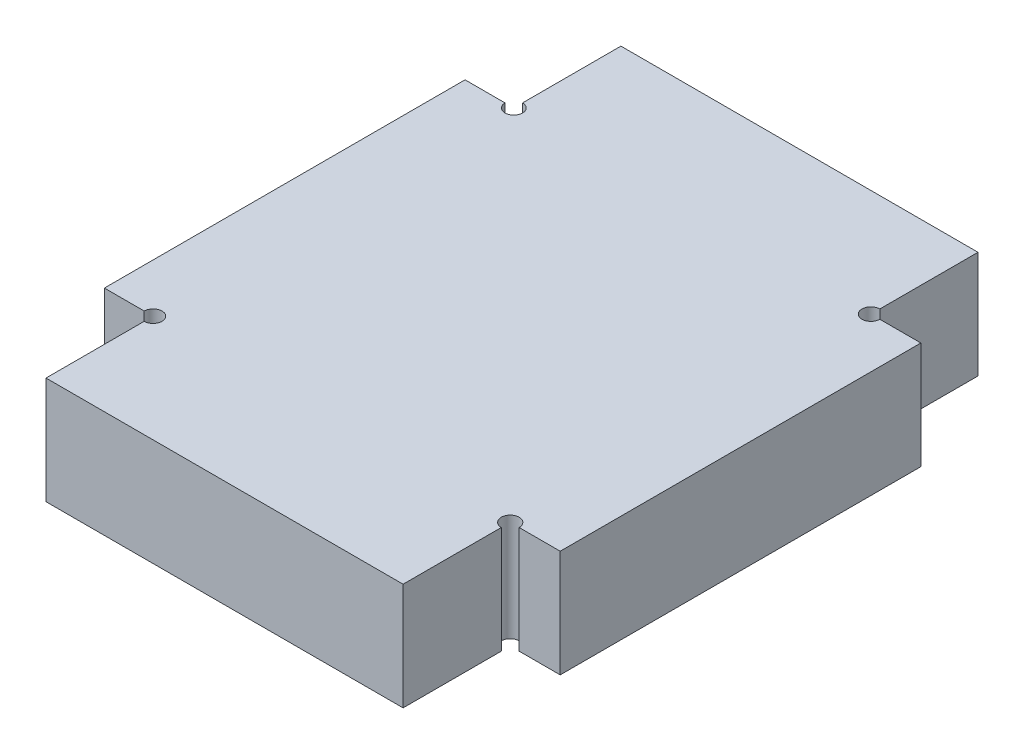
ISO-10303-21;
HEADER;
FILE_DESCRIPTION(('STEP AP214'),'2;1');
FILE_NAME('part.step','',(''),(''),'','','');
FILE_SCHEMA(('AUTOMOTIVE_DESIGN { 1 0 10303 214 1 1 1 1 }'));
ENDSEC;
DATA;
#1=APPLICATION_CONTEXT('core data for automotive mechanical design processes');
#2=APPLICATION_PROTOCOL_DEFINITION('international standard','automotive_design',2000,#1);
#3=PRODUCT_CONTEXT('',#1,'mechanical');
#4=PRODUCT('Part','Part','',(#3));
#5=PRODUCT_RELATED_PRODUCT_CATEGORY('part','',(#4));
#6=PRODUCT_DEFINITION_FORMATION('','',#4);
#7=PRODUCT_DEFINITION_CONTEXT('part definition',#1,'design');
#8=PRODUCT_DEFINITION('design','',#6,#7);
#9=PRODUCT_DEFINITION_SHAPE('','',#8);
#10=(LENGTH_UNIT() NAMED_UNIT(*) SI_UNIT(.MILLI.,.METRE.));
#11=(NAMED_UNIT(*) PLANE_ANGLE_UNIT() SI_UNIT($,.RADIAN.));
#12=(NAMED_UNIT(*) SI_UNIT($,.STERADIAN.) SOLID_ANGLE_UNIT());
#13=UNCERTAINTY_MEASURE_WITH_UNIT(LENGTH_MEASURE(1.E-05),#10,'distance_accuracy_value','');
#14=(GEOMETRIC_REPRESENTATION_CONTEXT(3) GLOBAL_UNCERTAINTY_ASSIGNED_CONTEXT((#13)) GLOBAL_UNIT_ASSIGNED_CONTEXT((#10,
#11,#12)) REPRESENTATION_CONTEXT('',''));
#15=CARTESIAN_POINT('',(0.,0.,0.));
#16=DIRECTION('',(0.,0.,1.));
#17=DIRECTION('',(1.,0.,0.));
#18=AXIS2_PLACEMENT_3D('',#15,#16,#17);
#19=CARTESIAN_POINT('',(1.4,3.,-5.33212290502793));
#20=DIRECTION('',(-1.,0.,0.));
#21=DIRECTION('',(0.,0.,1.));
#22=AXIS2_PLACEMENT_3D('',#19,#20,#21);
#23=PLANE('',#22);
#24=DIRECTION('',(0.,0.,-1.));
#25=VECTOR('',#24,1.);
#26=CARTESIAN_POINT('',(1.4,0.,-5.33212290502793));
#27=LINE('',#26,#25);
#28=CARTESIAN_POINT('',(1.4,0.,4.76787709497207));
#29=VERTEX_POINT('',#28);
#30=CARTESIAN_POINT('',(1.4,0.,-5.33212290502793));
#31=VERTEX_POINT('',#30);
#32=EDGE_CURVE('E177',#29,#31,#27,.T.);
#33=ORIENTED_EDGE('',*,*,#32,.T.);
#34=DIRECTION('',(0.,-1.,0.));
#35=VECTOR('',#34,1.);
#36=CARTESIAN_POINT('',(1.4,3.,-5.33212290502793));
#37=LINE('',#36,#35);
#38=CARTESIAN_POINT('',(1.4,3.,-5.33212290502793));
#39=VERTEX_POINT('',#38);
#40=EDGE_CURVE('E11',#39,#31,#37,.T.);
#41=ORIENTED_EDGE('',*,*,#40,.F.);
#42=DIRECTION('',(0.,0.,-1.));
#43=VECTOR('',#42,1.);
#44=CARTESIAN_POINT('',(1.4,3.,-5.33212290502793));
#45=LINE('',#44,#43);
#46=CARTESIAN_POINT('',(1.4,3.,4.76787709497207));
#47=VERTEX_POINT('',#46);
#48=EDGE_CURVE('E207',#47,#39,#45,.T.);
#49=ORIENTED_EDGE('',*,*,#48,.F.);
#50=DIRECTION('',(0.,-1.,0.));
#51=VECTOR('',#50,1.);
#52=CARTESIAN_POINT('',(1.4,3.,4.76787709497207));
#53=LINE('',#52,#51);
#54=EDGE_CURVE('E173',#47,#29,#53,.T.);
#55=ORIENTED_EDGE('',*,*,#54,.T.);
#56=EDGE_LOOP('',(#33,#41,#49,#55));
#57=FACE_BOUND('',#56,.T.);
#58=ADVANCED_FACE('F33',(#57),#23,.F.);
#59=CARTESIAN_POINT('',(0.25,3.,-5.33212290502793));
#60=DIRECTION('',(0.,0.,1.));
#61=DIRECTION('',(1.,0.,0.));
#62=AXIS2_PLACEMENT_3D('',#59,#60,#61);
#63=PLANE('',#62);
#64=DIRECTION('',(-1.,0.,0.));
#65=VECTOR('',#64,1.);
#66=CARTESIAN_POINT('',(0.25,0.,-5.33212290502793));
#67=LINE('',#66,#65);
#68=CARTESIAN_POINT('',(0.25,0.,-5.33212290502793));
#69=VERTEX_POINT('',#68);
#70=EDGE_CURVE('E180',#31,#69,#67,.T.);
#71=ORIENTED_EDGE('',*,*,#70,.T.);
#72=DIRECTION('',(0.,-1.,0.));
#73=VECTOR('',#72,1.);
#74=CARTESIAN_POINT('',(0.25,3.,-5.33212290502793));
#75=LINE('',#74,#73);
#76=CARTESIAN_POINT('',(0.25,3.,-5.33212290502793));
#77=VERTEX_POINT('',#76);
#78=EDGE_CURVE('E41',#77,#69,#75,.T.);
#79=ORIENTED_EDGE('',*,*,#78,.F.);
#80=DIRECTION('',(-1.,0.,0.));
#81=VECTOR('',#80,1.);
#82=CARTESIAN_POINT('',(0.25,3.,-5.33212290502793));
#83=LINE('',#82,#81);
#84=EDGE_CURVE('E116',#39,#77,#83,.T.);
#85=ORIENTED_EDGE('',*,*,#84,.F.);
#86=ORIENTED_EDGE('',*,*,#40,.T.);
#87=EDGE_LOOP('',(#71,#79,#85,#86));
#88=FACE_BOUND('',#87,.T.);
#89=ADVANCED_FACE('F305',(#88),#63,.F.);
#90=CARTESIAN_POINT('',(0.,3.,-5.33212290502793));
#91=DIRECTION('',(0.,-1.,0.));
#92=DIRECTION('',(0.,0.,-1.));
#93=AXIS2_PLACEMENT_3D('',#90,#91,#92);
#94=CYLINDRICAL_SURFACE('',#93,0.25);
#95=CARTESIAN_POINT('',(0.,0.,-5.33212290502793));
#96=DIRECTION('',(0.,-1.,0.));
#97=DIRECTION('',(0.,0.,1.));
#98=AXIS2_PLACEMENT_3D('',#95,#96,#97);
#99=CIRCLE('',#98,0.25);
#100=CARTESIAN_POINT('',(0.,0.,-5.58212290502793));
#101=VERTEX_POINT('',#100);
#102=EDGE_CURVE('E182',#69,#101,#99,.T.);
#103=ORIENTED_EDGE('',*,*,#102,.T.);
#104=DIRECTION('',(0.,-1.,0.));
#105=VECTOR('',#104,1.);
#106=CARTESIAN_POINT('',(0.,3.,-5.58212290502793));
#107=LINE('',#106,#105);
#108=CARTESIAN_POINT('',(0.,3.,-5.58212290502793));
#109=VERTEX_POINT('',#108);
#110=EDGE_CURVE('E238',#109,#101,#107,.T.);
#111=ORIENTED_EDGE('',*,*,#110,.F.);
#112=CARTESIAN_POINT('',(0.,3.,-5.33212290502793));
#113=DIRECTION('',(0.,-1.,0.));
#114=DIRECTION('',(0.,0.,1.));
#115=AXIS2_PLACEMENT_3D('',#112,#113,#114);
#116=CIRCLE('',#115,0.25);
#117=EDGE_CURVE('E246',#77,#109,#116,.T.);
#118=ORIENTED_EDGE('',*,*,#117,.F.);
#119=ORIENTED_EDGE('',*,*,#78,.T.);
#120=EDGE_LOOP('',(#103,#111,#118,#119));
#121=FACE_BOUND('',#120,.T.);
#122=ADVANCED_FACE('F244',(#121),#94,.F.);
#123=CARTESIAN_POINT('',(0.,3.,-5.58212290502793));
#124=DIRECTION('',(-1.,0.,0.));
#125=DIRECTION('',(0.,0.,1.));
#126=AXIS2_PLACEMENT_3D('',#123,#124,#125);
#127=PLANE('',#126);
#128=DIRECTION('',(0.,0.,-1.));
#129=VECTOR('',#128,1.);
#130=CARTESIAN_POINT('',(0.,0.,-5.58212290502793));
#131=LINE('',#130,#129);
#132=CARTESIAN_POINT('',(0.,0.,-8.33212290502794));
#133=VERTEX_POINT('',#132);
#134=EDGE_CURVE('E184',#101,#133,#131,.T.);
#135=ORIENTED_EDGE('',*,*,#134,.T.);
#136=DIRECTION('',(0.,-1.,0.));
#137=VECTOR('',#136,1.);
#138=CARTESIAN_POINT('',(0.,3.,-8.33212290502794));
#139=LINE('',#138,#137);
#140=CARTESIAN_POINT('',(0.,3.,-8.33212290502794));
#141=VERTEX_POINT('',#140);
#142=EDGE_CURVE('E235',#141,#133,#139,.T.);
#143=ORIENTED_EDGE('',*,*,#142,.F.);
#144=DIRECTION('',(0.,0.,-1.));
#145=VECTOR('',#144,1.);
#146=CARTESIAN_POINT('',(0.,3.,-5.58212290502793));
#147=LINE('',#146,#145);
#148=EDGE_CURVE('E264',#109,#141,#147,.T.);
#149=ORIENTED_EDGE('',*,*,#148,.F.);
#150=ORIENTED_EDGE('',*,*,#110,.T.);
#151=EDGE_LOOP('',(#135,#143,#149,#150));
#152=FACE_BOUND('',#151,.T.);
#153=ADVANCED_FACE('F255',(#152),#127,.F.);
#154=CARTESIAN_POINT('',(0.,3.,-8.33212290502794));
#155=DIRECTION('',(0.,0.,1.));
#156=DIRECTION('',(1.,0.,0.));
#157=AXIS2_PLACEMENT_3D('',#154,#155,#156);
#158=PLANE('',#157);
#159=DIRECTION('',(-1.,0.,0.));
#160=VECTOR('',#159,1.);
#161=CARTESIAN_POINT('',(0.,0.,-8.33212290502794));
#162=LINE('',#161,#160);
#163=CARTESIAN_POINT('',(-10.,0.,-8.33212290502793));
#164=VERTEX_POINT('',#163);
#165=EDGE_CURVE('E186',#133,#164,#162,.T.);
#166=ORIENTED_EDGE('',*,*,#165,.T.);
#167=DIRECTION('',(0.,-1.,0.));
#168=VECTOR('',#167,1.);
#169=CARTESIAN_POINT('',(-10.,3.,-8.33212290502793));
#170=LINE('',#169,#168);
#171=CARTESIAN_POINT('',(-10.,3.,-8.33212290502793));
#172=VERTEX_POINT('',#171);
#173=EDGE_CURVE('E232',#172,#164,#170,.T.);
#174=ORIENTED_EDGE('',*,*,#173,.F.);
#175=DIRECTION('',(-1.,0.,0.));
#176=VECTOR('',#175,1.);
#177=CARTESIAN_POINT('',(0.,3.,-8.33212290502794));
#178=LINE('',#177,#176);
#179=EDGE_CURVE('E261',#141,#172,#178,.T.);
#180=ORIENTED_EDGE('',*,*,#179,.F.);
#181=ORIENTED_EDGE('',*,*,#142,.T.);
#182=EDGE_LOOP('',(#166,#174,#180,#181));
#183=FACE_BOUND('',#182,.T.);
#184=ADVANCED_FACE('F259',(#183),#158,.F.);
#185=CARTESIAN_POINT('',(-10.,3.,-8.33212290502793));
#186=DIRECTION('',(1.,0.,0.));
#187=DIRECTION('',(0.,0.,-1.));
#188=AXIS2_PLACEMENT_3D('',#185,#186,#187);
#189=PLANE('',#188);
#190=DIRECTION('',(0.,0.,1.));
#191=VECTOR('',#190,1.);
#192=CARTESIAN_POINT('',(-10.,0.,-8.33212290502793));
#193=LINE('',#192,#191);
#194=CARTESIAN_POINT('',(-10.,0.,-5.57738217807717));
#195=VERTEX_POINT('',#194);
#196=EDGE_CURVE('E188',#164,#195,#193,.T.);
#197=ORIENTED_EDGE('',*,*,#196,.T.);
#198=DIRECTION('',(0.,-1.,0.));
#199=VECTOR('',#198,1.);
#200=CARTESIAN_POINT('',(-10.,3.,-5.57738217807717));
#201=LINE('',#200,#199);
#202=CARTESIAN_POINT('',(-10.,3.,-5.57738217807717));
#203=VERTEX_POINT('',#202);
#204=EDGE_CURVE('E229',#203,#195,#201,.T.);
#205=ORIENTED_EDGE('',*,*,#204,.F.);
#206=DIRECTION('',(0.,0.,1.));
#207=VECTOR('',#206,1.);
#208=CARTESIAN_POINT('',(-10.,3.,-8.33212290502793));
#209=LINE('',#208,#207);
#210=EDGE_CURVE('E263',#172,#203,#209,.T.);
#211=ORIENTED_EDGE('',*,*,#210,.F.);
#212=ORIENTED_EDGE('',*,*,#173,.T.);
#213=EDGE_LOOP('',(#197,#205,#211,#212));
#214=FACE_BOUND('',#213,.T.);
#215=ADVANCED_FACE('F318',(#214),#189,.F.);
#216=CARTESIAN_POINT('',(-10.,3.,-5.33212290502793));
#217=DIRECTION('',(0.,-1.,0.));
#218=DIRECTION('',(0.,0.,-1.));
#219=AXIS2_PLACEMENT_3D('',#216,#217,#218);
#220=CYLINDRICAL_SURFACE('',#219,0.245259273049239);
#221=CARTESIAN_POINT('',(-10.,0.,-5.33212290502793));
#222=DIRECTION('',(0.,-1.,0.));
#223=DIRECTION('',(0.,0.,1.));
#224=AXIS2_PLACEMENT_3D('',#221,#222,#223);
#225=CIRCLE('',#224,0.245259273049239);
#226=CARTESIAN_POINT('',(-10.2452592730492,0.,-5.33212290502793));
#227=VERTEX_POINT('',#226);
#228=EDGE_CURVE('E190',#195,#227,#225,.T.);
#229=ORIENTED_EDGE('',*,*,#228,.T.);
#230=DIRECTION('',(0.,-1.,0.));
#231=VECTOR('',#230,1.);
#232=CARTESIAN_POINT('',(-10.2452592730492,3.,-5.33212290502793));
#233=LINE('',#232,#231);
#234=CARTESIAN_POINT('',(-10.2452592730492,3.,-5.33212290502793));
#235=VERTEX_POINT('',#234);
#236=EDGE_CURVE('E226',#235,#227,#233,.T.);
#237=ORIENTED_EDGE('',*,*,#236,.F.);
#238=CARTESIAN_POINT('',(-10.,3.,-5.33212290502793));
#239=DIRECTION('',(0.,-1.,0.));
#240=DIRECTION('',(0.,0.,1.));
#241=AXIS2_PLACEMENT_3D('',#238,#239,#240);
#242=CIRCLE('',#241,0.245259273049239);
#243=EDGE_CURVE('E266',#203,#235,#242,.T.);
#244=ORIENTED_EDGE('',*,*,#243,.F.);
#245=ORIENTED_EDGE('',*,*,#204,.T.);
#246=EDGE_LOOP('',(#229,#237,#244,#245));
#247=FACE_BOUND('',#246,.T.);
#248=ADVANCED_FACE('F321',(#247),#220,.F.);
#249=CARTESIAN_POINT('',(-10.2452592730492,3.,-5.33212290502793));
#250=DIRECTION('',(0.,0.,1.));
#251=DIRECTION('',(1.,0.,0.));
#252=AXIS2_PLACEMENT_3D('',#249,#250,#251);
#253=PLANE('',#252);
#254=DIRECTION('',(-1.,0.,0.));
#255=VECTOR('',#254,1.);
#256=CARTESIAN_POINT('',(-10.2452592730492,0.,-5.33212290502793));
#257=LINE('',#256,#255);
#258=CARTESIAN_POINT('',(-11.3646914249073,0.,-5.33212290502793));
#259=VERTEX_POINT('',#258);
#260=EDGE_CURVE('E192',#227,#259,#257,.T.);
#261=ORIENTED_EDGE('',*,*,#260,.T.);
#262=DIRECTION('',(0.,-1.,0.));
#263=VECTOR('',#262,1.);
#264=CARTESIAN_POINT('',(-11.3646914249073,3.,-5.33212290502793));
#265=LINE('',#264,#263);
#266=CARTESIAN_POINT('',(-11.3646914249073,3.,-5.33212290502793));
#267=VERTEX_POINT('',#266);
#268=EDGE_CURVE('E223',#267,#259,#265,.T.);
#269=ORIENTED_EDGE('',*,*,#268,.F.);
#270=DIRECTION('',(-1.,0.,0.));
#271=VECTOR('',#270,1.);
#272=CARTESIAN_POINT('',(-10.2452592730492,3.,-5.33212290502793));
#273=LINE('',#272,#271);
#274=EDGE_CURVE('E272',#235,#267,#273,.T.);
#275=ORIENTED_EDGE('',*,*,#274,.F.);
#276=ORIENTED_EDGE('',*,*,#236,.T.);
#277=EDGE_LOOP('',(#261,#269,#275,#276));
#278=FACE_BOUND('',#277,.T.);
#279=ADVANCED_FACE('F325',(#278),#253,.F.);
#280=CARTESIAN_POINT('',(-11.3646914249073,3.,4.76787709497207));
#281=DIRECTION('',(1.,0.,0.));
#282=DIRECTION('',(0.,0.,-1.));
#283=AXIS2_PLACEMENT_3D('',#280,#281,#282);
#284=PLANE('',#283);
#285=DIRECTION('',(0.,0.,1.));
#286=VECTOR('',#285,1.);
#287=CARTESIAN_POINT('',(-11.3646914249073,0.,4.76787709497207));
#288=LINE('',#287,#286);
#289=CARTESIAN_POINT('',(-11.3646914249073,0.,4.76787709497207));
#290=VERTEX_POINT('',#289);
#291=EDGE_CURVE('E194',#259,#290,#288,.T.);
#292=ORIENTED_EDGE('',*,*,#291,.T.);
#293=DIRECTION('',(0.,-1.,0.));
#294=VECTOR('',#293,1.);
#295=CARTESIAN_POINT('',(-11.3646914249073,3.,4.76787709497207));
#296=LINE('',#295,#294);
#297=CARTESIAN_POINT('',(-11.3646914249073,3.,4.76787709497207));
#298=VERTEX_POINT('',#297);
#299=EDGE_CURVE('E220',#298,#290,#296,.T.);
#300=ORIENTED_EDGE('',*,*,#299,.F.);
#301=DIRECTION('',(0.,0.,1.));
#302=VECTOR('',#301,1.);
#303=CARTESIAN_POINT('',(-11.3646914249073,3.,4.76787709497207));
#304=LINE('',#303,#302);
#305=EDGE_CURVE('E274',#267,#298,#304,.T.);
#306=ORIENTED_EDGE('',*,*,#305,.F.);
#307=ORIENTED_EDGE('',*,*,#268,.T.);
#308=EDGE_LOOP('',(#292,#300,#306,#307));
#309=FACE_BOUND('',#308,.T.);
#310=ADVANCED_FACE('F329',(#309),#284,.F.);
#311=CARTESIAN_POINT('',(-10.25,3.,4.76787709497207));
#312=DIRECTION('',(0.,0.,-1.));
#313=DIRECTION('',(-1.,0.,0.));
#314=AXIS2_PLACEMENT_3D('',#311,#312,#313);
#315=PLANE('',#314);
#316=DIRECTION('',(1.,0.,0.));
#317=VECTOR('',#316,1.);
#318=CARTESIAN_POINT('',(-10.25,0.,4.76787709497207));
#319=LINE('',#318,#317);
#320=CARTESIAN_POINT('',(-10.25,0.,4.76787709497207));
#321=VERTEX_POINT('',#320);
#322=EDGE_CURVE('E196',#290,#321,#319,.T.);
#323=ORIENTED_EDGE('',*,*,#322,.T.);
#324=DIRECTION('',(0.,-1.,0.));
#325=VECTOR('',#324,1.);
#326=CARTESIAN_POINT('',(-10.25,3.,4.76787709497207));
#327=LINE('',#326,#325);
#328=CARTESIAN_POINT('',(-10.25,3.,4.76787709497207));
#329=VERTEX_POINT('',#328);
#330=EDGE_CURVE('E217',#329,#321,#327,.T.);
#331=ORIENTED_EDGE('',*,*,#330,.F.);
#332=DIRECTION('',(1.,0.,0.));
#333=VECTOR('',#332,1.);
#334=CARTESIAN_POINT('',(-10.25,3.,4.76787709497207));
#335=LINE('',#334,#333);
#336=EDGE_CURVE('E276',#298,#329,#335,.T.);
#337=ORIENTED_EDGE('',*,*,#336,.F.);
#338=ORIENTED_EDGE('',*,*,#299,.T.);
#339=EDGE_LOOP('',(#323,#331,#337,#338));
#340=FACE_BOUND('',#339,.T.);
#341=ADVANCED_FACE('F333',(#340),#315,.F.);
#342=CARTESIAN_POINT('',(-10.,3.,4.76787709497207));
#343=DIRECTION('',(0.,-1.,0.));
#344=DIRECTION('',(0.,0.,-1.));
#345=AXIS2_PLACEMENT_3D('',#342,#343,#344);
#346=CYLINDRICAL_SURFACE('',#345,0.25);
#347=CARTESIAN_POINT('',(-10.,0.,4.76787709497207));
#348=DIRECTION('',(0.,-1.,0.));
#349=DIRECTION('',(0.,0.,1.));
#350=AXIS2_PLACEMENT_3D('',#347,#348,#349);
#351=CIRCLE('',#350,0.25);
#352=CARTESIAN_POINT('',(-10.,0.,5.01787709497207));
#353=VERTEX_POINT('',#352);
#354=EDGE_CURVE('E198',#321,#353,#351,.T.);
#355=ORIENTED_EDGE('',*,*,#354,.T.);
#356=DIRECTION('',(0.,-1.,0.));
#357=VECTOR('',#356,1.);
#358=CARTESIAN_POINT('',(-10.,3.,5.01787709497207));
#359=LINE('',#358,#357);
#360=CARTESIAN_POINT('',(-10.,3.,5.01787709497207));
#361=VERTEX_POINT('',#360);
#362=EDGE_CURVE('E214',#361,#353,#359,.T.);
#363=ORIENTED_EDGE('',*,*,#362,.F.);
#364=CARTESIAN_POINT('',(-10.,3.,4.76787709497207));
#365=DIRECTION('',(0.,-1.,0.));
#366=DIRECTION('',(0.,0.,1.));
#367=AXIS2_PLACEMENT_3D('',#364,#365,#366);
#368=CIRCLE('',#367,0.25);
#369=EDGE_CURVE('E278',#329,#361,#368,.T.);
#370=ORIENTED_EDGE('',*,*,#369,.F.);
#371=ORIENTED_EDGE('',*,*,#330,.T.);
#372=EDGE_LOOP('',(#355,#363,#370,#371));
#373=FACE_BOUND('',#372,.T.);
#374=ADVANCED_FACE('F337',(#373),#346,.F.);
#375=CARTESIAN_POINT('',(-10.,3.,7.76787709497207));
#376=DIRECTION('',(1.,0.,0.));
#377=DIRECTION('',(0.,0.,-1.));
#378=AXIS2_PLACEMENT_3D('',#375,#376,#377);
#379=PLANE('',#378);
#380=DIRECTION('',(0.,0.,1.));
#381=VECTOR('',#380,1.);
#382=CARTESIAN_POINT('',(-10.,0.,7.76787709497207));
#383=LINE('',#382,#381);
#384=CARTESIAN_POINT('',(-10.,0.,7.76787709497207));
#385=VERTEX_POINT('',#384);
#386=EDGE_CURVE('E200',#353,#385,#383,.T.);
#387=ORIENTED_EDGE('',*,*,#386,.T.);
#388=DIRECTION('',(0.,-1.,0.));
#389=VECTOR('',#388,1.);
#390=CARTESIAN_POINT('',(-10.,3.,7.76787709497207));
#391=LINE('',#390,#389);
#392=CARTESIAN_POINT('',(-10.,3.,7.76787709497207));
#393=VERTEX_POINT('',#392);
#394=EDGE_CURVE('E211',#393,#385,#391,.T.);
#395=ORIENTED_EDGE('',*,*,#394,.F.);
#396=DIRECTION('',(0.,0.,1.));
#397=VECTOR('',#396,1.);
#398=CARTESIAN_POINT('',(-10.,3.,7.76787709497207));
#399=LINE('',#398,#397);
#400=EDGE_CURVE('E280',#361,#393,#399,.T.);
#401=ORIENTED_EDGE('',*,*,#400,.F.);
#402=ORIENTED_EDGE('',*,*,#362,.T.);
#403=EDGE_LOOP('',(#387,#395,#401,#402));
#404=FACE_BOUND('',#403,.T.);
#405=ADVANCED_FACE('F286',(#404),#379,.F.);
#406=CARTESIAN_POINT('',(0.,3.,7.76787709497207));
#407=DIRECTION('',(0.,0.,-1.));
#408=DIRECTION('',(-1.,0.,0.));
#409=AXIS2_PLACEMENT_3D('',#406,#407,#408);
#410=PLANE('',#409);
#411=DIRECTION('',(1.,0.,0.));
#412=VECTOR('',#411,1.);
#413=CARTESIAN_POINT('',(0.,0.,7.76787709497207));
#414=LINE('',#413,#412);
#415=CARTESIAN_POINT('',(0.,0.,7.76787709497207));
#416=VERTEX_POINT('',#415);
#417=EDGE_CURVE('E202',#385,#416,#414,.T.);
#418=ORIENTED_EDGE('',*,*,#417,.T.);
#419=DIRECTION('',(0.,-1.,0.));
#420=VECTOR('',#419,1.);
#421=CARTESIAN_POINT('',(0.,3.,7.76787709497207));
#422=LINE('',#421,#420);
#423=CARTESIAN_POINT('',(0.,3.,7.76787709497207));
#424=VERTEX_POINT('',#423);
#425=EDGE_CURVE('E168',#424,#416,#422,.T.);
#426=ORIENTED_EDGE('',*,*,#425,.F.);
#427=DIRECTION('',(1.,0.,0.));
#428=VECTOR('',#427,1.);
#429=CARTESIAN_POINT('',(0.,3.,7.76787709497207));
#430=LINE('',#429,#428);
#431=EDGE_CURVE('E159',#393,#424,#430,.T.);
#432=ORIENTED_EDGE('',*,*,#431,.F.);
#433=ORIENTED_EDGE('',*,*,#394,.T.);
#434=EDGE_LOOP('',(#418,#426,#432,#433));
#435=FACE_BOUND('',#434,.T.);
#436=ADVANCED_FACE('F290',(#435),#410,.F.);
#437=CARTESIAN_POINT('',(0.,3.,5.01787709497207));
#438=DIRECTION('',(-1.,0.,0.));
#439=DIRECTION('',(0.,0.,1.));
#440=AXIS2_PLACEMENT_3D('',#437,#438,#439);
#441=PLANE('',#440);
#442=DIRECTION('',(0.,0.,-1.));
#443=VECTOR('',#442,1.);
#444=CARTESIAN_POINT('',(0.,0.,5.01787709497207));
#445=LINE('',#444,#443);
#446=CARTESIAN_POINT('',(0.,0.,5.01787709497207));
#447=VERTEX_POINT('',#446);
#448=EDGE_CURVE('E167',#416,#447,#445,.T.);
#449=ORIENTED_EDGE('',*,*,#448,.T.);
#450=DIRECTION('',(0.,-1.,0.));
#451=VECTOR('',#450,1.);
#452=CARTESIAN_POINT('',(0.,3.,5.01787709497207));
#453=LINE('',#452,#451);
#454=CARTESIAN_POINT('',(0.,3.,5.01787709497207));
#455=VERTEX_POINT('',#454);
#456=EDGE_CURVE('E164',#455,#447,#453,.T.);
#457=ORIENTED_EDGE('',*,*,#456,.F.);
#458=DIRECTION('',(0.,0.,-1.));
#459=VECTOR('',#458,1.);
#460=CARTESIAN_POINT('',(0.,3.,5.01787709497207));
#461=LINE('',#460,#459);
#462=EDGE_CURVE('E153',#424,#455,#461,.T.);
#463=ORIENTED_EDGE('',*,*,#462,.F.);
#464=ORIENTED_EDGE('',*,*,#425,.T.);
#465=EDGE_LOOP('',(#449,#457,#463,#464));
#466=FACE_BOUND('',#465,.T.);
#467=ADVANCED_FACE('F165',(#466),#441,.F.);
#468=CARTESIAN_POINT('',(0.,3.,4.76787709497207));
#469=DIRECTION('',(0.,-1.,0.));
#470=DIRECTION('',(0.,0.,-1.));
#471=AXIS2_PLACEMENT_3D('',#468,#469,#470);
#472=CYLINDRICAL_SURFACE('',#471,0.25);
#473=CARTESIAN_POINT('',(0.,0.,4.76787709497207));
#474=DIRECTION('',(0.,-1.,0.));
#475=DIRECTION('',(0.,0.,1.));
#476=AXIS2_PLACEMENT_3D('',#473,#474,#475);
#477=CIRCLE('',#476,0.25);
#478=CARTESIAN_POINT('',(0.25,0.,4.76787709497207));
#479=VERTEX_POINT('',#478);
#480=EDGE_CURVE('E102',#447,#479,#477,.T.);
#481=ORIENTED_EDGE('',*,*,#480,.T.);
#482=DIRECTION('',(0.,-1.,0.));
#483=VECTOR('',#482,1.);
#484=CARTESIAN_POINT('',(0.25,3.,4.76787709497207));
#485=LINE('',#484,#483);
#486=CARTESIAN_POINT('',(0.25,3.,4.76787709497207));
#487=VERTEX_POINT('',#486);
#488=EDGE_CURVE('E169',#487,#479,#485,.T.);
#489=ORIENTED_EDGE('',*,*,#488,.F.);
#490=CARTESIAN_POINT('',(0.,3.,4.76787709497207));
#491=DIRECTION('',(0.,-1.,0.));
#492=DIRECTION('',(0.,0.,1.));
#493=AXIS2_PLACEMENT_3D('',#490,#491,#492);
#494=CIRCLE('',#493,0.25);
#495=EDGE_CURVE('E157',#455,#487,#494,.T.);
#496=ORIENTED_EDGE('',*,*,#495,.F.);
#497=ORIENTED_EDGE('',*,*,#456,.T.);
#498=EDGE_LOOP('',(#481,#489,#496,#497));
#499=FACE_BOUND('',#498,.T.);
#500=ADVANCED_FACE('F171',(#499),#472,.F.);
#501=CARTESIAN_POINT('',(1.4,3.,4.76787709497207));
#502=DIRECTION('',(0.,0.,-1.));
#503=DIRECTION('',(-1.,0.,0.));
#504=AXIS2_PLACEMENT_3D('',#501,#502,#503);
#505=PLANE('',#504);
#506=DIRECTION('',(1.,0.,0.));
#507=VECTOR('',#506,1.);
#508=CARTESIAN_POINT('',(1.4,0.,4.76787709497207));
#509=LINE('',#508,#507);
#510=EDGE_CURVE('E108',#479,#29,#509,.T.);
#511=ORIENTED_EDGE('',*,*,#510,.T.);
#512=ORIENTED_EDGE('',*,*,#54,.F.);
#513=DIRECTION('',(1.,0.,0.));
#514=VECTOR('',#513,1.);
#515=CARTESIAN_POINT('',(1.4,3.,4.76787709497207));
#516=LINE('',#515,#514);
#517=EDGE_CURVE('E49',#487,#47,#516,.T.);
#518=ORIENTED_EDGE('',*,*,#517,.F.);
#519=ORIENTED_EDGE('',*,*,#488,.T.);
#520=EDGE_LOOP('',(#511,#512,#518,#519));
#521=FACE_BOUND('',#520,.T.);
#522=ADVANCED_FACE('F294',(#521),#505,.F.);
#523=CARTESIAN_POINT('',(0.,3.,4.76787709497207));
#524=DIRECTION('',(0.,1.,0.));
#525=DIRECTION('',(0.,0.,1.));
#526=AXIS2_PLACEMENT_3D('',#523,#524,#525);
#527=PLANE('',#526);
#528=ORIENTED_EDGE('',*,*,#48,.T.);
#529=ORIENTED_EDGE('',*,*,#84,.T.);
#530=ORIENTED_EDGE('',*,*,#117,.T.);
#531=ORIENTED_EDGE('',*,*,#148,.T.);
#532=ORIENTED_EDGE('',*,*,#179,.T.);
#533=ORIENTED_EDGE('',*,*,#210,.T.);
#534=ORIENTED_EDGE('',*,*,#243,.T.);
#535=ORIENTED_EDGE('',*,*,#274,.T.);
#536=ORIENTED_EDGE('',*,*,#305,.T.);
#537=ORIENTED_EDGE('',*,*,#336,.T.);
#538=ORIENTED_EDGE('',*,*,#369,.T.);
#539=ORIENTED_EDGE('',*,*,#400,.T.);
#540=ORIENTED_EDGE('',*,*,#431,.T.);
#541=ORIENTED_EDGE('',*,*,#462,.T.);
#542=ORIENTED_EDGE('',*,*,#495,.T.);
#543=ORIENTED_EDGE('',*,*,#517,.T.);
#544=EDGE_LOOP('',(#528,#529,#530,#531,#532,#533,#534,#535,#536,#537,#538,#539,#540,#541,#542,#543));
#545=FACE_BOUND('',#544,.T.);
#546=ADVANCED_FACE('F155',(#545),#527,.T.);
#547=CARTESIAN_POINT('',(0.,0.,4.76787709497207));
#548=DIRECTION('',(0.,1.,0.));
#549=DIRECTION('',(0.,0.,1.));
#550=AXIS2_PLACEMENT_3D('',#547,#548,#549);
#551=PLANE('',#550);
#552=ORIENTED_EDGE('',*,*,#32,.F.);
#553=ORIENTED_EDGE('',*,*,#510,.F.);
#554=ORIENTED_EDGE('',*,*,#480,.F.);
#555=ORIENTED_EDGE('',*,*,#448,.F.);
#556=ORIENTED_EDGE('',*,*,#417,.F.);
#557=ORIENTED_EDGE('',*,*,#386,.F.);
#558=ORIENTED_EDGE('',*,*,#354,.F.);
#559=ORIENTED_EDGE('',*,*,#322,.F.);
#560=ORIENTED_EDGE('',*,*,#291,.F.);
#561=ORIENTED_EDGE('',*,*,#260,.F.);
#562=ORIENTED_EDGE('',*,*,#228,.F.);
#563=ORIENTED_EDGE('',*,*,#196,.F.);
#564=ORIENTED_EDGE('',*,*,#165,.F.);
#565=ORIENTED_EDGE('',*,*,#134,.F.);
#566=ORIENTED_EDGE('',*,*,#102,.F.);
#567=ORIENTED_EDGE('',*,*,#70,.F.);
#568=EDGE_LOOP('',(#552,#553,#554,#555,#556,#557,#558,#559,#560,#561,#562,#563,#564,#565,#566,#567));
#569=FACE_BOUND('',#568,.T.);
#570=ADVANCED_FACE('F250',(#569),#551,.F.);
#571=CLOSED_SHELL('',(#58,#89,#122,#153,#184,#215,#248,#279,#310,#341,#374,#405,#436,#467,#500,
#522,#546,#570));
#572=MANIFOLD_SOLID_BREP('B2',#571);
#573=ADVANCED_BREP_SHAPE_REPRESENTATION('',(#18,#572),#14);
#574=SHAPE_DEFINITION_REPRESENTATION(#9,#573);
ENDSEC;
END-ISO-10303-21;
